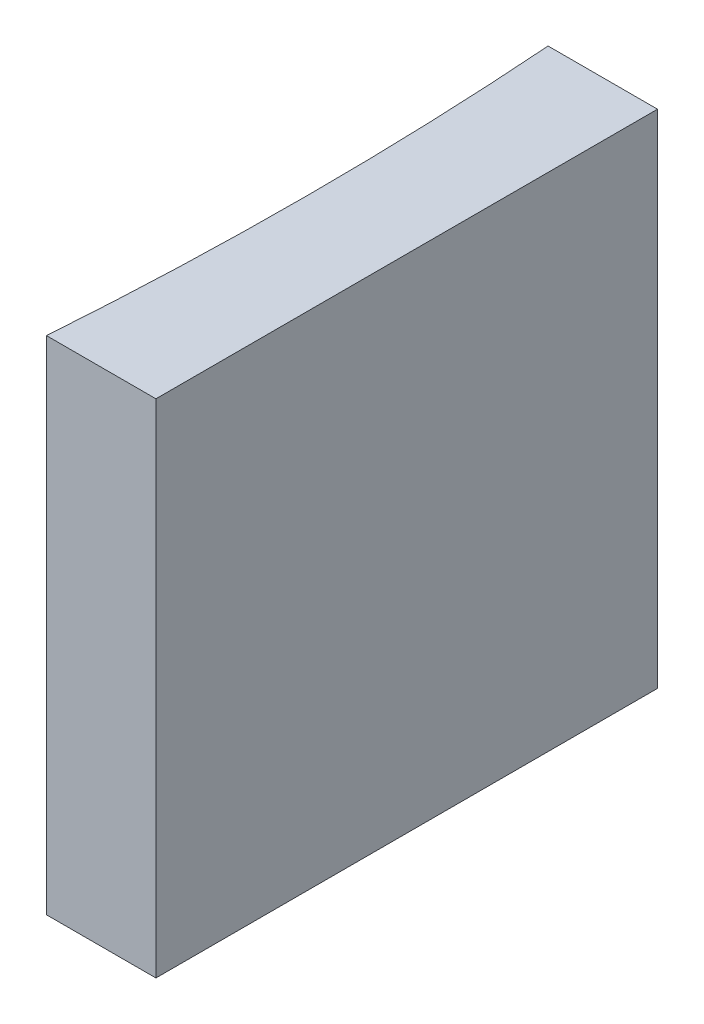
ISO-10303-21;
HEADER;
FILE_DESCRIPTION(('STEP AP214'),'2;1');
FILE_NAME('part.step','',(''),(''),'','','');
FILE_SCHEMA(('AUTOMOTIVE_DESIGN { 1 0 10303 214 1 1 1 1 }'));
ENDSEC;
DATA;
#1=APPLICATION_CONTEXT('core data for automotive mechanical design processes');
#2=APPLICATION_PROTOCOL_DEFINITION('international standard','automotive_design',2000,#1);
#3=PRODUCT_CONTEXT('',#1,'mechanical');
#4=PRODUCT('Part','Part','',(#3));
#5=PRODUCT_RELATED_PRODUCT_CATEGORY('part','',(#4));
#6=PRODUCT_DEFINITION_FORMATION('','',#4);
#7=PRODUCT_DEFINITION_CONTEXT('part definition',#1,'design');
#8=PRODUCT_DEFINITION('design','',#6,#7);
#9=PRODUCT_DEFINITION_SHAPE('','',#8);
#10=(LENGTH_UNIT() NAMED_UNIT(*) SI_UNIT(.MILLI.,.METRE.));
#11=(NAMED_UNIT(*) PLANE_ANGLE_UNIT() SI_UNIT($,.RADIAN.));
#12=(NAMED_UNIT(*) SI_UNIT($,.STERADIAN.) SOLID_ANGLE_UNIT());
#13=UNCERTAINTY_MEASURE_WITH_UNIT(LENGTH_MEASURE(1.E-05),#10,'distance_accuracy_value','');
#14=(GEOMETRIC_REPRESENTATION_CONTEXT(3) GLOBAL_UNCERTAINTY_ASSIGNED_CONTEXT((#13)) GLOBAL_UNIT_ASSIGNED_CONTEXT((#10,
#11,#12)) REPRESENTATION_CONTEXT('',''));
#15=CARTESIAN_POINT('',(0.,0.,0.));
#16=DIRECTION('',(0.,0.,1.));
#17=DIRECTION('',(1.,0.,0.));
#18=AXIS2_PLACEMENT_3D('',#15,#16,#17);
#19=CARTESIAN_POINT('',(0.,10.,0.));
#20=DIRECTION('',(0.,0.,1.));
#21=DIRECTION('',(1.,0.,0.));
#22=AXIS2_PLACEMENT_3D('',#19,#20,#21);
#23=PLANE('',#22);
#24=DIRECTION('',(-1.,0.,0.));
#25=VECTOR('',#24,1.);
#26=CARTESIAN_POINT('',(0.,0.,0.));
#27=LINE('',#26,#25);
#28=CARTESIAN_POINT('',(0.,0.,0.));
#29=VERTEX_POINT('',#28);
#30=CARTESIAN_POINT('',(-2.18197962040012,0.,0.));
#31=VERTEX_POINT('',#30);
#32=EDGE_CURVE('E100',#29,#31,#27,.T.);
#33=ORIENTED_EDGE('',*,*,#32,.T.);
#34=DIRECTION('',(0.,-1.,0.));
#35=VECTOR('',#34,1.);
#36=CARTESIAN_POINT('',(-2.18197962040012,10.,0.));
#37=LINE('',#36,#35);
#38=CARTESIAN_POINT('',(-2.18197962040012,10.,0.));
#39=VERTEX_POINT('',#38);
#40=EDGE_CURVE('E11',#39,#31,#37,.T.);
#41=ORIENTED_EDGE('',*,*,#40,.F.);
#42=DIRECTION('',(-1.,0.,0.));
#43=VECTOR('',#42,1.);
#44=CARTESIAN_POINT('',(0.,10.,0.));
#45=LINE('',#44,#43);
#46=CARTESIAN_POINT('',(0.,10.,0.));
#47=VERTEX_POINT('',#46);
#48=EDGE_CURVE('E88',#47,#39,#45,.T.);
#49=ORIENTED_EDGE('',*,*,#48,.F.);
#50=DIRECTION('',(0.,-1.,0.));
#51=VECTOR('',#50,1.);
#52=CARTESIAN_POINT('',(0.,10.,0.));
#53=LINE('',#52,#51);
#54=EDGE_CURVE('E96',#47,#29,#53,.T.);
#55=ORIENTED_EDGE('',*,*,#54,.T.);
#56=EDGE_LOOP('',(#33,#41,#49,#55));
#57=FACE_BOUND('',#56,.T.);
#58=ADVANCED_FACE('F37',(#57),#23,.F.);
#59=CARTESIAN_POINT('',(-70.78,10.,5.00000000000001));
#60=DIRECTION('',(0.,-1.,0.));
#61=DIRECTION('',(0.,0.,-1.));
#62=AXIS2_PLACEMENT_3D('',#59,#60,#61);
#63=CYLINDRICAL_SURFACE('',#62,68.78);
#64=CARTESIAN_POINT('',(-70.78,0.,5.00000000000001));
#65=DIRECTION('',(0.,-1.,0.));
#66=DIRECTION('',(0.,0.,1.));
#67=AXIS2_PLACEMENT_3D('',#64,#65,#66);
#68=CIRCLE('',#67,68.78);
#69=CARTESIAN_POINT('',(-2.18197962040012,0.,10.));
#70=VERTEX_POINT('',#69);
#71=EDGE_CURVE('E92',#31,#70,#68,.T.);
#72=ORIENTED_EDGE('',*,*,#71,.T.);
#73=DIRECTION('',(0.,-1.,0.));
#74=VECTOR('',#73,1.);
#75=CARTESIAN_POINT('',(-2.18197962040012,10.,10.));
#76=LINE('',#75,#74);
#77=CARTESIAN_POINT('',(-2.18197962040012,10.,10.));
#78=VERTEX_POINT('',#77);
#79=EDGE_CURVE('E45',#78,#70,#76,.T.);
#80=ORIENTED_EDGE('',*,*,#79,.F.);
#81=CARTESIAN_POINT('',(-70.78,10.,5.00000000000001));
#82=DIRECTION('',(0.,-1.,0.));
#83=DIRECTION('',(0.,0.,1.));
#84=AXIS2_PLACEMENT_3D('',#81,#82,#83);
#85=CIRCLE('',#84,68.78);
#86=EDGE_CURVE('E83',#39,#78,#85,.T.);
#87=ORIENTED_EDGE('',*,*,#86,.F.);
#88=ORIENTED_EDGE('',*,*,#40,.T.);
#89=EDGE_LOOP('',(#72,#80,#87,#88));
#90=FACE_BOUND('',#89,.T.);
#91=ADVANCED_FACE('F91',(#90),#63,.F.);
#92=CARTESIAN_POINT('',(0.,10.,10.));
#93=DIRECTION('',(0.,0.,-1.));
#94=DIRECTION('',(-1.,0.,0.));
#95=AXIS2_PLACEMENT_3D('',#92,#93,#94);
#96=PLANE('',#95);
#97=DIRECTION('',(1.,0.,0.));
#98=VECTOR('',#97,1.);
#99=CARTESIAN_POINT('',(0.,0.,10.));
#100=LINE('',#99,#98);
#101=CARTESIAN_POINT('',(0.,0.,10.));
#102=VERTEX_POINT('',#101);
#103=EDGE_CURVE('E70',#70,#102,#100,.T.);
#104=ORIENTED_EDGE('',*,*,#103,.T.);
#105=DIRECTION('',(0.,-1.,0.));
#106=VECTOR('',#105,1.);
#107=CARTESIAN_POINT('',(0.,10.,10.));
#108=LINE('',#107,#106);
#109=CARTESIAN_POINT('',(0.,10.,10.));
#110=VERTEX_POINT('',#109);
#111=EDGE_CURVE('E93',#110,#102,#108,.T.);
#112=ORIENTED_EDGE('',*,*,#111,.F.);
#113=DIRECTION('',(1.,0.,0.));
#114=VECTOR('',#113,1.);
#115=CARTESIAN_POINT('',(0.,10.,10.));
#116=LINE('',#115,#114);
#117=EDGE_CURVE('E86',#78,#110,#116,.T.);
#118=ORIENTED_EDGE('',*,*,#117,.F.);
#119=ORIENTED_EDGE('',*,*,#79,.T.);
#120=EDGE_LOOP('',(#104,#112,#118,#119));
#121=FACE_BOUND('',#120,.T.);
#122=ADVANCED_FACE('F94',(#121),#96,.F.);
#123=CARTESIAN_POINT('',(0.,10.,0.));
#124=DIRECTION('',(-1.,0.,0.));
#125=DIRECTION('',(0.,0.,1.));
#126=AXIS2_PLACEMENT_3D('',#123,#124,#125);
#127=PLANE('',#126);
#128=DIRECTION('',(0.,0.,-1.));
#129=VECTOR('',#128,1.);
#130=CARTESIAN_POINT('',(0.,0.,0.));
#131=LINE('',#130,#129);
#132=EDGE_CURVE('E76',#102,#29,#131,.T.);
#133=ORIENTED_EDGE('',*,*,#132,.T.);
#134=ORIENTED_EDGE('',*,*,#54,.F.);
#135=DIRECTION('',(0.,0.,-1.));
#136=VECTOR('',#135,1.);
#137=CARTESIAN_POINT('',(0.,10.,0.));
#138=LINE('',#137,#136);
#139=EDGE_CURVE('E53',#110,#47,#138,.T.);
#140=ORIENTED_EDGE('',*,*,#139,.F.);
#141=ORIENTED_EDGE('',*,*,#111,.T.);
#142=EDGE_LOOP('',(#133,#134,#140,#141));
#143=FACE_BOUND('',#142,.T.);
#144=ADVANCED_FACE('F107',(#143),#127,.F.);
#145=CARTESIAN_POINT('',(-70.78,10.,5.00000000000001));
#146=DIRECTION('',(0.,1.,0.));
#147=DIRECTION('',(0.,0.,1.));
#148=AXIS2_PLACEMENT_3D('',#145,#146,#147);
#149=PLANE('',#148);
#150=ORIENTED_EDGE('',*,*,#48,.T.);
#151=ORIENTED_EDGE('',*,*,#86,.T.);
#152=ORIENTED_EDGE('',*,*,#117,.T.);
#153=ORIENTED_EDGE('',*,*,#139,.T.);
#154=EDGE_LOOP('',(#150,#151,#152,#153));
#155=FACE_BOUND('',#154,.T.);
#156=ADVANCED_FACE('F84',(#155),#149,.T.);
#157=CARTESIAN_POINT('',(-70.78,0.,5.00000000000001));
#158=DIRECTION('',(0.,1.,0.));
#159=DIRECTION('',(0.,0.,1.));
#160=AXIS2_PLACEMENT_3D('',#157,#158,#159);
#161=PLANE('',#160);
#162=ORIENTED_EDGE('',*,*,#32,.F.);
#163=ORIENTED_EDGE('',*,*,#132,.F.);
#164=ORIENTED_EDGE('',*,*,#103,.F.);
#165=ORIENTED_EDGE('',*,*,#71,.F.);
#166=EDGE_LOOP('',(#162,#163,#164,#165));
#167=FACE_BOUND('',#166,.T.);
#168=ADVANCED_FACE('F110',(#167),#161,.F.);
#169=CLOSED_SHELL('',(#58,#91,#122,#144,#156,#168));
#170=MANIFOLD_SOLID_BREP('B2',#169);
#171=ADVANCED_BREP_SHAPE_REPRESENTATION('',(#18,#170),#14);
#172=SHAPE_DEFINITION_REPRESENTATION(#9,#171);
ENDSEC;
END-ISO-10303-21;
